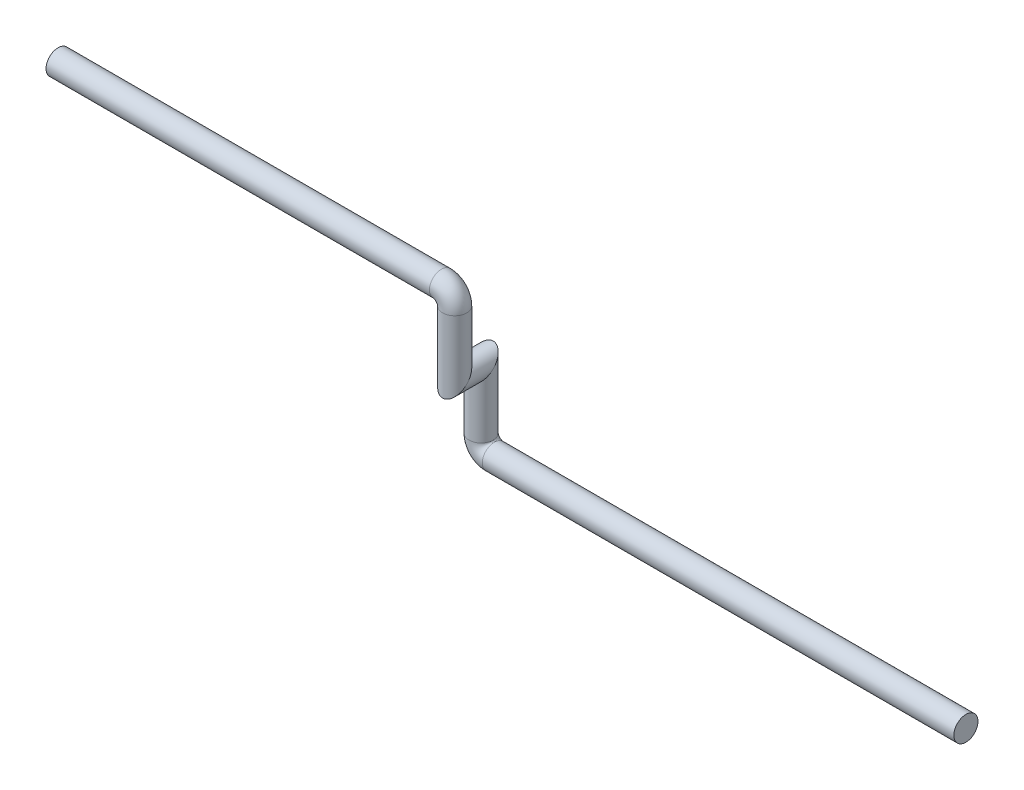
ISO-10303-21;
HEADER;
FILE_DESCRIPTION(('STEP AP214'),'2;1');
FILE_NAME('part.step','',(''),(''),'','','');
FILE_SCHEMA(('AUTOMOTIVE_DESIGN { 1 0 10303 214 1 1 1 1 }'));
ENDSEC;
DATA;
#1=APPLICATION_CONTEXT('core data for automotive mechanical design processes');
#2=APPLICATION_PROTOCOL_DEFINITION('international standard','automotive_design',2000,#1);
#3=PRODUCT_CONTEXT('',#1,'mechanical');
#4=PRODUCT('Part','Part','',(#3));
#5=PRODUCT_RELATED_PRODUCT_CATEGORY('part','',(#4));
#6=PRODUCT_DEFINITION_FORMATION('','',#4);
#7=PRODUCT_DEFINITION_CONTEXT('part definition',#1,'design');
#8=PRODUCT_DEFINITION('design','',#6,#7);
#9=PRODUCT_DEFINITION_SHAPE('','',#8);
#10=(LENGTH_UNIT() NAMED_UNIT(*) SI_UNIT(.MILLI.,.METRE.));
#11=(NAMED_UNIT(*) PLANE_ANGLE_UNIT() SI_UNIT($,.RADIAN.));
#12=(NAMED_UNIT(*) SI_UNIT($,.STERADIAN.) SOLID_ANGLE_UNIT());
#13=UNCERTAINTY_MEASURE_WITH_UNIT(LENGTH_MEASURE(1.E-05),#10,'distance_accuracy_value','');
#14=(GEOMETRIC_REPRESENTATION_CONTEXT(3) GLOBAL_UNCERTAINTY_ASSIGNED_CONTEXT((#13)) GLOBAL_UNIT_ASSIGNED_CONTEXT((#10,
#11,#12)) REPRESENTATION_CONTEXT('',''));
#15=CARTESIAN_POINT('',(0.,0.,0.));
#16=DIRECTION('',(0.,0.,1.));
#17=DIRECTION('',(1.,0.,0.));
#18=AXIS2_PLACEMENT_3D('',#15,#16,#17);
#19=CARTESIAN_POINT('',(-565.,170.,30.));
#20=DIRECTION('',(-1.,0.,0.));
#21=DIRECTION('',(0.,-1.,0.));
#22=AXIS2_PLACEMENT_3D('',#19,#20,#21);
#23=CYLINDRICAL_SURFACE('',#22,13.7);
#24=CARTESIAN_POINT('',(-565.,170.,30.));
#25=DIRECTION('',(-1.,0.,0.));
#26=DIRECTION('',(0.,0.,1.));
#27=AXIS2_PLACEMENT_3D('',#24,#25,#26);
#28=CIRCLE('',#27,13.7);
#29=CARTESIAN_POINT('',(-565.,183.7,30.));
#30=VERTEX_POINT('',#29);
#31=EDGE_CURVE('E44',#30,#30,#28,.T.);
#32=ORIENTED_EDGE('',*,*,#31,.T.);
#33=EDGE_LOOP('',(#32));
#34=FACE_BOUND('',#33,.T.);
#35=CARTESIAN_POINT('',(-1000.,170.,30.));
#36=DIRECTION('',(-1.,0.,0.));
#37=DIRECTION('',(0.,0.,1.));
#38=AXIS2_PLACEMENT_3D('',#35,#36,#37);
#39=CIRCLE('',#38,13.7);
#40=CARTESIAN_POINT('',(-1000.,170.,43.7));
#41=VERTEX_POINT('',#40);
#42=EDGE_CURVE('E11',#41,#41,#39,.T.);
#43=ORIENTED_EDGE('',*,*,#42,.F.);
#44=EDGE_LOOP('',(#43));
#45=FACE_BOUND('',#44,.T.);
#46=ADVANCED_FACE('F38',(#34,#45),#23,.T.);
#47=CARTESIAN_POINT('',(-565.,155.,30.));
#48=DIRECTION('',(0.,0.,1.));
#49=DIRECTION('',(1.,0.,0.));
#50=AXIS2_PLACEMENT_3D('',#47,#48,#49);
#51=TOROIDAL_SURFACE('',#50,15.,13.7);
#52=CARTESIAN_POINT('',(-550.,155.,30.));
#53=DIRECTION('',(0.,1.,0.));
#54=DIRECTION('',(0.,0.,1.));
#55=AXIS2_PLACEMENT_3D('',#52,#53,#54);
#56=CIRCLE('',#55,13.7);
#57=CARTESIAN_POINT('',(-536.3,155.,30.));
#58=VERTEX_POINT('',#57);
#59=EDGE_CURVE('E48',#58,#58,#56,.T.);
#60=CARTESIAN_POINT('',(-565.,155.,30.));
#61=DIRECTION('',(0.,0.,1.));
#62=DIRECTION('',(1.,0.,0.));
#63=AXIS2_PLACEMENT_3D('',#60,#61,#62);
#64=CIRCLE('',#63,28.7);
#65=EDGE_CURVE('',#58,#30,#64,.T.);
#66=ORIENTED_EDGE('',*,*,#59,.T.);
#67=ORIENTED_EDGE('',*,*,#31,.F.);
#68=ORIENTED_EDGE('',*,*,#65,.T.);
#69=ORIENTED_EDGE('',*,*,#65,.F.);
#70=EDGE_LOOP('',(#66,#68,#67,#69));
#71=FACE_BOUND('',#70,.T.);
#72=ADVANCED_FACE('F94',(#71),#51,.T.);
#73=CARTESIAN_POINT('',(-550.,85.,30.));
#74=DIRECTION('',(0.,1.,0.));
#75=DIRECTION('',(0.,0.,1.));
#76=AXIS2_PLACEMENT_3D('',#73,#74,#75);
#77=CYLINDRICAL_SURFACE('',#76,13.7);
#78=CARTESIAN_POINT('',(-550.,85.,30.));
#79=DIRECTION('',(0.,0.707106781186548,0.707106781186548));
#80=DIRECTION('',(0.,-0.707106781186548,0.707106781186548));
#81=AXIS2_PLACEMENT_3D('',#78,#79,#80);
#82=ELLIPSE('',#81,19.3747258045114,13.7);
#83=CARTESIAN_POINT('',(-550.,71.3,43.7));
#84=VERTEX_POINT('',#83);
#85=EDGE_CURVE('E52',#84,#84,#82,.F.);
#86=ORIENTED_EDGE('',*,*,#85,.F.);
#87=EDGE_LOOP('',(#86));
#88=FACE_BOUND('',#87,.T.);
#89=ORIENTED_EDGE('',*,*,#59,.F.);
#90=EDGE_LOOP('',(#89));
#91=FACE_BOUND('',#90,.T.);
#92=ADVANCED_FACE('F88',(#88,#91),#77,.T.);
#93=CARTESIAN_POINT('',(-550.,85.,0.));
#94=DIRECTION('',(0.,0.,1.));
#95=DIRECTION('',(1.,0.,0.));
#96=AXIS2_PLACEMENT_3D('',#93,#94,#95);
#97=CYLINDRICAL_SURFACE('',#96,13.7);
#98=CARTESIAN_POINT('',(-550.,85.,0.));
#99=DIRECTION('',(0.,0.707106781186548,0.707106781186548));
#100=DIRECTION('',(0.,0.707106781186548,-0.707106781186548));
#101=AXIS2_PLACEMENT_3D('',#98,#99,#100);
#102=ELLIPSE('',#101,19.3747258045114,13.7);
#103=CARTESIAN_POINT('',(-550.,98.7,-13.7));
#104=VERTEX_POINT('',#103);
#105=EDGE_CURVE('E57',#104,#104,#102,.T.);
#106=ORIENTED_EDGE('',*,*,#105,.T.);
#107=EDGE_LOOP('',(#106));
#108=FACE_BOUND('',#107,.T.);
#109=ORIENTED_EDGE('',*,*,#85,.T.);
#110=EDGE_LOOP('',(#109));
#111=FACE_BOUND('',#110,.T.);
#112=ADVANCED_FACE('F82',(#108,#111),#97,.T.);
#113=CARTESIAN_POINT('',(-550.,15.,0.));
#114=DIRECTION('',(0.,1.,0.));
#115=DIRECTION('',(0.,0.,1.));
#116=AXIS2_PLACEMENT_3D('',#113,#114,#115);
#117=CYLINDRICAL_SURFACE('',#116,13.7);
#118=CARTESIAN_POINT('',(-550.,15.,0.));
#119=DIRECTION('',(0.,-1.,0.));
#120=DIRECTION('',(0.,0.,-1.));
#121=AXIS2_PLACEMENT_3D('',#118,#119,#120);
#122=CIRCLE('',#121,13.7);
#123=CARTESIAN_POINT('',(-563.7,15.,0.));
#124=VERTEX_POINT('',#123);
#125=EDGE_CURVE('E60',#124,#124,#122,.T.);
#126=ORIENTED_EDGE('',*,*,#125,.F.);
#127=EDGE_LOOP('',(#126));
#128=FACE_BOUND('',#127,.T.);
#129=ORIENTED_EDGE('',*,*,#105,.F.);
#130=EDGE_LOOP('',(#129));
#131=FACE_BOUND('',#130,.T.);
#132=ADVANCED_FACE('F76',(#128,#131),#117,.T.);
#133=CARTESIAN_POINT('',(-535.,15.,0.));
#134=DIRECTION('',(0.,0.,-1.));
#135=DIRECTION('',(-1.,0.,0.));
#136=AXIS2_PLACEMENT_3D('',#133,#134,#135);
#137=TOROIDAL_SURFACE('',#136,15.,13.7);
#138=CARTESIAN_POINT('',(-535.,0.,0.));
#139=DIRECTION('',(1.,0.,0.));
#140=DIRECTION('',(0.,0.,-1.));
#141=AXIS2_PLACEMENT_3D('',#138,#139,#140);
#142=CIRCLE('',#141,13.7);
#143=CARTESIAN_POINT('',(-535.,-13.7,0.));
#144=VERTEX_POINT('',#143);
#145=EDGE_CURVE('E63',#144,#144,#142,.T.);
#146=CARTESIAN_POINT('',(-535.,15.,0.));
#147=DIRECTION('',(0.,0.,-1.));
#148=DIRECTION('',(-1.,0.,0.));
#149=AXIS2_PLACEMENT_3D('',#146,#147,#148);
#150=CIRCLE('',#149,28.7);
#151=EDGE_CURVE('',#144,#124,#150,.T.);
#152=ORIENTED_EDGE('',*,*,#145,.F.);
#153=ORIENTED_EDGE('',*,*,#125,.T.);
#154=ORIENTED_EDGE('',*,*,#151,.T.);
#155=ORIENTED_EDGE('',*,*,#151,.F.);
#156=EDGE_LOOP('',(#152,#154,#153,#155));
#157=FACE_BOUND('',#156,.T.);
#158=ADVANCED_FACE('F73',(#157),#137,.T.);
#159=CARTESIAN_POINT('',(-535.,0.,0.));
#160=DIRECTION('',(1.,0.,0.));
#161=DIRECTION('',(0.,0.,-1.));
#162=AXIS2_PLACEMENT_3D('',#159,#160,#161);
#163=CYLINDRICAL_SURFACE('',#162,13.7);
#164=ORIENTED_EDGE('',*,*,#145,.T.);
#165=EDGE_LOOP('',(#164));
#166=FACE_BOUND('',#165,.T.);
#167=CARTESIAN_POINT('',(0.,0.,0.));
#168=DIRECTION('',(1.,0.,0.));
#169=DIRECTION('',(0.,0.,-1.));
#170=AXIS2_PLACEMENT_3D('',#167,#168,#169);
#171=CIRCLE('',#170,13.7);
#172=CARTESIAN_POINT('',(0.,0.,-13.7));
#173=VERTEX_POINT('',#172);
#174=EDGE_CURVE('E64',#173,#173,#171,.T.);
#175=ORIENTED_EDGE('',*,*,#174,.F.);
#176=EDGE_LOOP('',(#175));
#177=FACE_BOUND('',#176,.T.);
#178=ADVANCED_FACE('F70',(#166,#177),#163,.T.);
#179=CARTESIAN_POINT('',(0.,0.,0.));
#180=DIRECTION('',(1.,0.,0.));
#181=DIRECTION('',(0.,0.,-1.));
#182=AXIS2_PLACEMENT_3D('',#179,#180,#181);
#183=PLANE('',#182);
#184=ORIENTED_EDGE('',*,*,#174,.T.);
#185=EDGE_LOOP('',(#184));
#186=FACE_BOUND('',#185,.T.);
#187=ADVANCED_FACE('F106',(#186),#183,.T.);
#188=CARTESIAN_POINT('',(-1000.,170.,30.));
#189=DIRECTION('',(-1.,0.,0.));
#190=DIRECTION('',(0.,0.,1.));
#191=AXIS2_PLACEMENT_3D('',#188,#189,#190);
#192=PLANE('',#191);
#193=ORIENTED_EDGE('',*,*,#42,.T.);
#194=EDGE_LOOP('',(#193));
#195=FACE_BOUND('',#194,.T.);
#196=ADVANCED_FACE('F109',(#195),#192,.T.);
#197=CLOSED_SHELL('',(#46,#72,#92,#112,#132,#158,#178,#187,#196));
#198=MANIFOLD_SOLID_BREP('B2',#197);
#199=ADVANCED_BREP_SHAPE_REPRESENTATION('',(#18,#198),#14);
#200=SHAPE_DEFINITION_REPRESENTATION(#9,#199);
ENDSEC;
END-ISO-10303-21;
